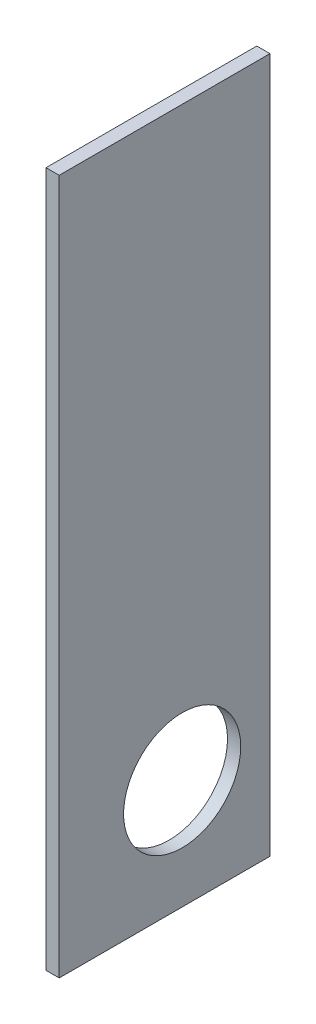
ISO-10303-21;
HEADER;
FILE_DESCRIPTION(('STEP AP214'),'2;1');
FILE_NAME('part.step','',(''),(''),'','','');
FILE_SCHEMA(('AUTOMOTIVE_DESIGN { 1 0 10303 214 1 1 1 1 }'));
ENDSEC;
DATA;
#1=APPLICATION_CONTEXT('core data for automotive mechanical design processes');
#2=APPLICATION_PROTOCOL_DEFINITION('international standard','automotive_design',2000,#1);
#3=PRODUCT_CONTEXT('',#1,'mechanical');
#4=PRODUCT('Part','Part','',(#3));
#5=PRODUCT_RELATED_PRODUCT_CATEGORY('part','',(#4));
#6=PRODUCT_DEFINITION_FORMATION('','',#4);
#7=PRODUCT_DEFINITION_CONTEXT('part definition',#1,'design');
#8=PRODUCT_DEFINITION('design','',#6,#7);
#9=PRODUCT_DEFINITION_SHAPE('','',#8);
#10=(LENGTH_UNIT() NAMED_UNIT(*) SI_UNIT(.MILLI.,.METRE.));
#11=(NAMED_UNIT(*) PLANE_ANGLE_UNIT() SI_UNIT($,.RADIAN.));
#12=(NAMED_UNIT(*) SI_UNIT($,.STERADIAN.) SOLID_ANGLE_UNIT());
#13=UNCERTAINTY_MEASURE_WITH_UNIT(LENGTH_MEASURE(1.E-05),#10,'distance_accuracy_value','');
#14=(GEOMETRIC_REPRESENTATION_CONTEXT(3) GLOBAL_UNCERTAINTY_ASSIGNED_CONTEXT((#13)) GLOBAL_UNIT_ASSIGNED_CONTEXT((#10,
#11,#12)) REPRESENTATION_CONTEXT('',''));
#15=CARTESIAN_POINT('',(0.,0.,0.));
#16=DIRECTION('',(0.,0.,1.));
#17=DIRECTION('',(1.,0.,0.));
#18=AXIS2_PLACEMENT_3D('',#15,#16,#17);
#19=CARTESIAN_POINT('',(18.,-892.219556499024,267.607933188847));
#20=DIRECTION('',(0.,0.,-1.));
#21=DIRECTION('',(-1.,0.,0.));
#22=AXIS2_PLACEMENT_3D('',#19,#20,#21);
#23=PLANE('',#22);
#24=DIRECTION('',(0.,-1.,0.));
#25=VECTOR('',#24,1.);
#26=CARTESIAN_POINT('',(0.,-892.219556499024,267.607933188847));
#27=LINE('',#26,#25);
#28=CARTESIAN_POINT('',(0.,57.7804435009756,267.607933188847));
#29=VERTEX_POINT('',#28);
#30=CARTESIAN_POINT('',(0.,-892.219556499024,267.607933188847));
#31=VERTEX_POINT('',#30);
#32=EDGE_CURVE('E96',#29,#31,#27,.T.);
#33=ORIENTED_EDGE('',*,*,#32,.T.);
#34=DIRECTION('',(-1.,0.,0.));
#35=VECTOR('',#34,1.);
#36=CARTESIAN_POINT('',(18.,-892.219556499024,267.607933188847));
#37=LINE('',#36,#35);
#38=CARTESIAN_POINT('',(18.,-892.219556499024,267.607933188847));
#39=VERTEX_POINT('',#38);
#40=EDGE_CURVE('E11',#39,#31,#37,.T.);
#41=ORIENTED_EDGE('',*,*,#40,.F.);
#42=DIRECTION('',(0.,-1.,0.));
#43=VECTOR('',#42,1.);
#44=CARTESIAN_POINT('',(18.,-892.219556499024,267.607933188847));
#45=LINE('',#44,#43);
#46=CARTESIAN_POINT('',(18.,57.7804435009756,267.607933188847));
#47=VERTEX_POINT('',#46);
#48=EDGE_CURVE('E84',#47,#39,#45,.T.);
#49=ORIENTED_EDGE('',*,*,#48,.F.);
#50=DIRECTION('',(-1.,0.,0.));
#51=VECTOR('',#50,1.);
#52=CARTESIAN_POINT('',(18.,57.7804435009756,267.607933188847));
#53=LINE('',#52,#51);
#54=EDGE_CURVE('E92',#47,#29,#53,.T.);
#55=ORIENTED_EDGE('',*,*,#54,.T.);
#56=EDGE_LOOP('',(#33,#41,#49,#55));
#57=FACE_BOUND('',#56,.T.);
#58=ADVANCED_FACE('F33',(#57),#23,.F.);
#59=CARTESIAN_POINT('',(18.,-892.219556499024,-20.392066811153));
#60=DIRECTION('',(0.,1.,0.));
#61=DIRECTION('',(0.,0.,1.));
#62=AXIS2_PLACEMENT_3D('',#59,#60,#61);
#63=PLANE('',#62);
#64=DIRECTION('',(0.,0.,-1.));
#65=VECTOR('',#64,1.);
#66=CARTESIAN_POINT('',(0.,-892.219556499024,-20.392066811153));
#67=LINE('',#66,#65);
#68=CARTESIAN_POINT('',(0.,-892.219556499024,-20.392066811153));
#69=VERTEX_POINT('',#68);
#70=EDGE_CURVE('E88',#31,#69,#67,.T.);
#71=ORIENTED_EDGE('',*,*,#70,.T.);
#72=DIRECTION('',(-1.,0.,0.));
#73=VECTOR('',#72,1.);
#74=CARTESIAN_POINT('',(18.,-892.219556499024,-20.392066811153));
#75=LINE('',#74,#73);
#76=CARTESIAN_POINT('',(18.,-892.219556499024,-20.392066811153));
#77=VERTEX_POINT('',#76);
#78=EDGE_CURVE('E41',#77,#69,#75,.T.);
#79=ORIENTED_EDGE('',*,*,#78,.F.);
#80=DIRECTION('',(0.,0.,-1.));
#81=VECTOR('',#80,1.);
#82=CARTESIAN_POINT('',(18.,-892.219556499024,-20.392066811153));
#83=LINE('',#82,#81);
#84=EDGE_CURVE('E79',#39,#77,#83,.T.);
#85=ORIENTED_EDGE('',*,*,#84,.F.);
#86=ORIENTED_EDGE('',*,*,#40,.T.);
#87=EDGE_LOOP('',(#71,#79,#85,#86));
#88=FACE_BOUND('',#87,.T.);
#89=ADVANCED_FACE('F87',(#88),#63,.F.);
#90=CARTESIAN_POINT('',(18.,-892.219556499024,-20.392066811153));
#91=DIRECTION('',(0.,0.,1.));
#92=DIRECTION('',(1.,0.,0.));
#93=AXIS2_PLACEMENT_3D('',#90,#91,#92);
#94=PLANE('',#93);
#95=DIRECTION('',(0.,1.,0.));
#96=VECTOR('',#95,1.);
#97=CARTESIAN_POINT('',(0.,-892.219556499024,-20.392066811153));
#98=LINE('',#97,#96);
#99=CARTESIAN_POINT('',(0.,57.7804435009756,-20.392066811153));
#100=VERTEX_POINT('',#99);
#101=EDGE_CURVE('E66',#69,#100,#98,.T.);
#102=ORIENTED_EDGE('',*,*,#101,.T.);
#103=DIRECTION('',(-1.,0.,0.));
#104=VECTOR('',#103,1.);
#105=CARTESIAN_POINT('',(18.,57.7804435009756,-20.392066811153));
#106=LINE('',#105,#104);
#107=CARTESIAN_POINT('',(18.,57.7804435009756,-20.392066811153));
#108=VERTEX_POINT('',#107);
#109=EDGE_CURVE('E89',#108,#100,#106,.T.);
#110=ORIENTED_EDGE('',*,*,#109,.F.);
#111=DIRECTION('',(0.,1.,0.));
#112=VECTOR('',#111,1.);
#113=CARTESIAN_POINT('',(18.,-892.219556499024,-20.392066811153));
#114=LINE('',#113,#112);
#115=EDGE_CURVE('E82',#77,#108,#114,.T.);
#116=ORIENTED_EDGE('',*,*,#115,.F.);
#117=ORIENTED_EDGE('',*,*,#78,.T.);
#118=EDGE_LOOP('',(#102,#110,#116,#117));
#119=FACE_BOUND('',#118,.T.);
#120=ADVANCED_FACE('F90',(#119),#94,.F.);
#121=CARTESIAN_POINT('',(18.,57.7804435009756,-20.392066811153));
#122=DIRECTION('',(0.,-1.,0.));
#123=DIRECTION('',(0.,0.,-1.));
#124=AXIS2_PLACEMENT_3D('',#121,#122,#123);
#125=PLANE('',#124);
#126=DIRECTION('',(0.,0.,1.));
#127=VECTOR('',#126,1.);
#128=CARTESIAN_POINT('',(0.,57.7804435009756,-20.392066811153));
#129=LINE('',#128,#127);
#130=EDGE_CURVE('E72',#100,#29,#129,.T.);
#131=ORIENTED_EDGE('',*,*,#130,.T.);
#132=ORIENTED_EDGE('',*,*,#54,.F.);
#133=DIRECTION('',(0.,0.,1.));
#134=VECTOR('',#133,1.);
#135=CARTESIAN_POINT('',(18.,57.7804435009756,-20.392066811153));
#136=LINE('',#135,#134);
#137=EDGE_CURVE('E49',#108,#47,#136,.T.);
#138=ORIENTED_EDGE('',*,*,#137,.F.);
#139=ORIENTED_EDGE('',*,*,#109,.T.);
#140=EDGE_LOOP('',(#131,#132,#138,#139));
#141=FACE_BOUND('',#140,.T.);
#142=ADVANCED_FACE('F104',(#141),#125,.F.);
#143=CARTESIAN_POINT('',(18.,0.,0.));
#144=DIRECTION('',(1.,0.,0.));
#145=DIRECTION('',(0.,0.,-1.));
#146=AXIS2_PLACEMENT_3D('',#143,#144,#145);
#147=PLANE('',#146);
#148=CARTESIAN_POINT('',(18.,-742.219556499024,99.607933188847));
#149=DIRECTION('',(1.,0.,0.));
#150=DIRECTION('',(0.,0.,-1.));
#151=AXIS2_PLACEMENT_3D('',#148,#149,#150);
#152=CIRCLE('',#151,80.);
#153=CARTESIAN_POINT('',(18.,-742.219556499024,19.607933188847));
#154=VERTEX_POINT('',#153);
#155=EDGE_CURVE('E110',#154,#154,#152,.T.);
#156=ORIENTED_EDGE('',*,*,#155,.F.);
#157=EDGE_LOOP('',(#156));
#158=FACE_BOUND('',#157,.T.);
#159=ORIENTED_EDGE('',*,*,#48,.T.);
#160=ORIENTED_EDGE('',*,*,#84,.T.);
#161=ORIENTED_EDGE('',*,*,#115,.T.);
#162=ORIENTED_EDGE('',*,*,#137,.T.);
#163=EDGE_LOOP('',(#159,#160,#161,#162));
#164=FACE_BOUND('',#163,.T.);
#165=ADVANCED_FACE('F80',(#158,#164),#147,.T.);
#166=CARTESIAN_POINT('',(0.,0.,0.));
#167=DIRECTION('',(1.,0.,0.));
#168=DIRECTION('',(0.,0.,-1.));
#169=AXIS2_PLACEMENT_3D('',#166,#167,#168);
#170=PLANE('',#169);
#171=CARTESIAN_POINT('',(0.,-742.219556499024,99.607933188847));
#172=DIRECTION('',(1.,0.,0.));
#173=DIRECTION('',(0.,0.,-1.));
#174=AXIS2_PLACEMENT_3D('',#171,#172,#173);
#175=CIRCLE('',#174,80.);
#176=CARTESIAN_POINT('',(0.,-742.219556499024,19.607933188847));
#177=VERTEX_POINT('',#176);
#178=EDGE_CURVE('E99',#177,#177,#175,.T.);
#179=ORIENTED_EDGE('',*,*,#178,.T.);
#180=EDGE_LOOP('',(#179));
#181=FACE_BOUND('',#180,.T.);
#182=ORIENTED_EDGE('',*,*,#32,.F.);
#183=ORIENTED_EDGE('',*,*,#130,.F.);
#184=ORIENTED_EDGE('',*,*,#101,.F.);
#185=ORIENTED_EDGE('',*,*,#70,.F.);
#186=EDGE_LOOP('',(#182,#183,#184,#185));
#187=FACE_BOUND('',#186,.T.);
#188=ADVANCED_FACE('F107',(#181,#187),#170,.F.);
#189=CARTESIAN_POINT('',(0.,-742.219556499024,99.607933188847));
#190=DIRECTION('',(1.,0.,0.));
#191=DIRECTION('',(0.,0.,-1.));
#192=AXIS2_PLACEMENT_3D('',#189,#190,#191);
#193=CYLINDRICAL_SURFACE('',#192,80.);
#194=ORIENTED_EDGE('',*,*,#178,.F.);
#195=EDGE_LOOP('',(#194));
#196=FACE_BOUND('',#195,.T.);
#197=ORIENTED_EDGE('',*,*,#155,.T.);
#198=EDGE_LOOP('',(#197));
#199=FACE_BOUND('',#198,.T.);
#200=ADVANCED_FACE('F117',(#196,#199),#193,.F.);
#201=CLOSED_SHELL('',(#58,#89,#120,#142,#165,#188,#200));
#202=MANIFOLD_SOLID_BREP('B2',#201);
#203=ADVANCED_BREP_SHAPE_REPRESENTATION('',(#18,#202),#14);
#204=SHAPE_DEFINITION_REPRESENTATION(#9,#203);
ENDSEC;
END-ISO-10303-21;
